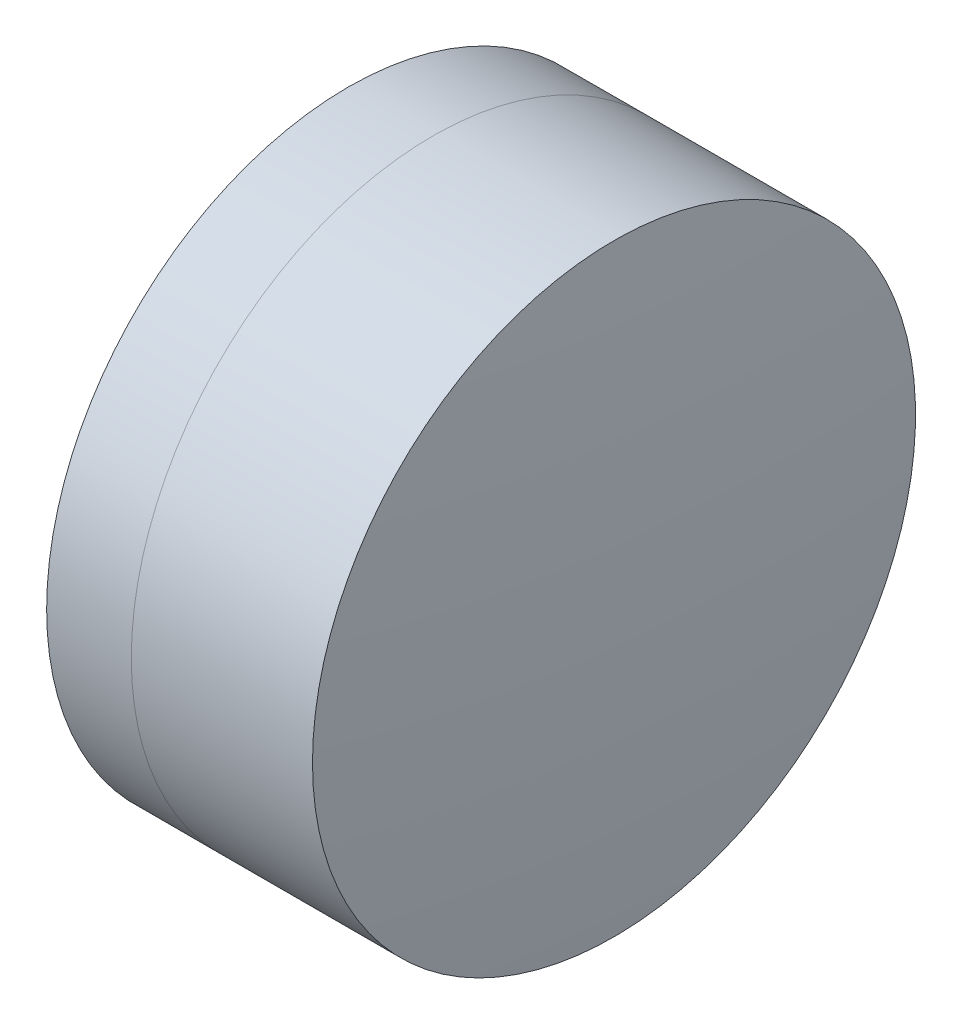
ISO-10303-21;
HEADER;
FILE_DESCRIPTION(('STEP AP214'),'2;1');
FILE_NAME('part.step','',(''),(''),'','','');
FILE_SCHEMA(('AUTOMOTIVE_DESIGN { 1 0 10303 214 1 1 1 1 }'));
ENDSEC;
DATA;
#1=APPLICATION_CONTEXT('core data for automotive mechanical design processes');
#2=APPLICATION_PROTOCOL_DEFINITION('international standard','automotive_design',2000,#1);
#3=PRODUCT_CONTEXT('',#1,'mechanical');
#4=PRODUCT('Part','Part','',(#3));
#5=PRODUCT_RELATED_PRODUCT_CATEGORY('part','',(#4));
#6=PRODUCT_DEFINITION_FORMATION('','',#4);
#7=PRODUCT_DEFINITION_CONTEXT('part definition',#1,'design');
#8=PRODUCT_DEFINITION('design','',#6,#7);
#9=PRODUCT_DEFINITION_SHAPE('','',#8);
#10=(LENGTH_UNIT() NAMED_UNIT(*) SI_UNIT(.MILLI.,.METRE.));
#11=(NAMED_UNIT(*) PLANE_ANGLE_UNIT() SI_UNIT($,.RADIAN.));
#12=(NAMED_UNIT(*) SI_UNIT($,.STERADIAN.) SOLID_ANGLE_UNIT());
#13=UNCERTAINTY_MEASURE_WITH_UNIT(LENGTH_MEASURE(1.E-05),#10,'distance_accuracy_value','');
#14=(GEOMETRIC_REPRESENTATION_CONTEXT(3) GLOBAL_UNCERTAINTY_ASSIGNED_CONTEXT((#13)) GLOBAL_UNIT_ASSIGNED_CONTEXT((#10,
#11,#12)) REPRESENTATION_CONTEXT('',''));
#15=CARTESIAN_POINT('',(0.,0.,0.));
#16=DIRECTION('',(0.,0.,1.));
#17=DIRECTION('',(1.,0.,0.));
#18=AXIS2_PLACEMENT_3D('',#15,#16,#17);
#19=CARTESIAN_POINT('',(-9.12217084702924,0.,0.));
#20=DIRECTION('',(-1.,0.,0.));
#21=DIRECTION('',(0.,0.,1.));
#22=AXIS2_PLACEMENT_3D('',#19,#20,#21);
#23=SPHERICAL_SURFACE('',#22,10.6);
#24=CARTESIAN_POINT('',(-0.634680051747038,0.,0.));
#25=DIRECTION('',(-1.,0.,0.));
#26=DIRECTION('',(0.,0.,1.));
#27=AXIS2_PLACEMENT_3D('',#24,#25,#26);
#28=CIRCLE('',#27,6.35);
#29=CARTESIAN_POINT('',(-0.634680051747038,0.,6.35));
#30=VERTEX_POINT('',#29);
#31=EDGE_CURVE('E11',#30,#30,#28,.T.);
#32=ORIENTED_EDGE('',*,*,#31,.T.);
#33=EDGE_LOOP('',(#32));
#34=FACE_BOUND('',#33,.T.);
#35=ADVANCED_FACE('F53',(#34),#23,.F.);
#36=CARTESIAN_POINT('',(-0.551919992657797,0.,0.));
#37=DIRECTION('',(-1.,0.,0.));
#38=DIRECTION('',(0.,0.,1.));
#39=AXIS2_PLACEMENT_3D('',#36,#37,#38);
#40=CYLINDRICAL_SURFACE('',#39,6.35);
#41=CARTESIAN_POINT('',(3.18112922015039,0.,0.));
#42=DIRECTION('',(-1.,0.,0.));
#43=DIRECTION('',(0.,0.,1.));
#44=AXIS2_PLACEMENT_3D('',#41,#42,#43);
#45=CIRCLE('',#44,6.35);
#46=CARTESIAN_POINT('',(3.18112922015039,0.,6.35));
#47=VERTEX_POINT('',#46);
#48=EDGE_CURVE('E60',#47,#47,#45,.T.);
#49=ORIENTED_EDGE('',*,*,#48,.T.);
#50=EDGE_LOOP('',(#49));
#51=FACE_BOUND('',#50,.T.);
#52=ORIENTED_EDGE('',*,*,#31,.F.);
#53=EDGE_LOOP('',(#52));
#54=FACE_BOUND('',#53,.T.);
#55=ADVANCED_FACE('F67',(#51,#54),#40,.T.);
#56=CARTESIAN_POINT('',(-64.6221708470292,0.,0.));
#57=DIRECTION('',(-1.,0.,0.));
#58=DIRECTION('',(0.,0.,1.));
#59=AXIS2_PLACEMENT_3D('',#56,#57,#58);
#60=SPHERICAL_SURFACE('',#59,68.1);
#61=ORIENTED_EDGE('',*,*,#48,.F.);
#62=EDGE_LOOP('',(#61));
#63=FACE_BOUND('',#62,.T.);
#64=ADVANCED_FACE('F70',(#63),#60,.T.);
#65=CLOSED_SHELL('',(#35,#55,#64));
#66=MANIFOLD_SOLID_BREP('B2',#65);
#67=CARTESIAN_POINT('',(15.2778291529708,0.,0.));
#68=DIRECTION('',(-1.,0.,0.));
#69=DIRECTION('',(0.,0.,-1.));
#70=AXIS2_PLACEMENT_3D('',#67,#68,#69);
#71=SPHERICAL_SURFACE('',#70,18.8);
#72=CARTESIAN_POINT('',(-2.41729729472664,0.,0.));
#73=DIRECTION('',(-1.,0.,0.));
#74=DIRECTION('',(0.,0.,1.));
#75=AXIS2_PLACEMENT_3D('',#72,#73,#74);
#76=CIRCLE('',#75,6.35);
#77=CARTESIAN_POINT('',(-2.41729729472664,0.,6.35));
#78=VERTEX_POINT('',#77);
#79=EDGE_CURVE('E52',#78,#78,#76,.T.);
#80=ORIENTED_EDGE('',*,*,#79,.T.);
#81=EDGE_LOOP('',(#80));
#82=FACE_BOUND('',#81,.T.);
#83=ADVANCED_FACE('F101',(#82),#71,.T.);
#84=CARTESIAN_POINT('',(-9.70261217833668,0.,0.));
#85=DIRECTION('',(-1.,0.,0.));
#86=DIRECTION('',(0.,0.,1.));
#87=AXIS2_PLACEMENT_3D('',#84,#85,#86);
#88=CYLINDRICAL_SURFACE('',#87,6.35);
#89=CARTESIAN_POINT('',(-0.634680051747036,0.,0.));
#90=DIRECTION('',(-1.,0.,0.));
#91=DIRECTION('',(0.,0.,1.));
#92=AXIS2_PLACEMENT_3D('',#89,#90,#91);
#93=CIRCLE('',#92,6.35);
#94=CARTESIAN_POINT('',(-0.634680051747036,0.,6.35));
#95=VERTEX_POINT('',#94);
#96=EDGE_CURVE('E108',#95,#95,#93,.T.);
#97=ORIENTED_EDGE('',*,*,#96,.T.);
#98=EDGE_LOOP('',(#97));
#99=FACE_BOUND('',#98,.T.);
#100=ORIENTED_EDGE('',*,*,#79,.F.);
#101=EDGE_LOOP('',(#100));
#102=FACE_BOUND('',#101,.T.);
#103=ADVANCED_FACE('F115',(#99,#102),#88,.T.);
#104=CARTESIAN_POINT('',(-9.12217084702924,0.,0.));
#105=DIRECTION('',(-1.,0.,0.));
#106=DIRECTION('',(0.,0.,1.));
#107=AXIS2_PLACEMENT_3D('',#104,#105,#106);
#108=SPHERICAL_SURFACE('',#107,10.6);
#109=ORIENTED_EDGE('',*,*,#96,.F.);
#110=EDGE_LOOP('',(#109));
#111=FACE_BOUND('',#110,.T.);
#112=ADVANCED_FACE('F118',(#111),#108,.T.);
#113=CLOSED_SHELL('',(#83,#103,#112));
#114=MANIFOLD_SOLID_BREP('B6',#113);
#115=ADVANCED_BREP_SHAPE_REPRESENTATION('',(#18,#66,#114),#14);
#116=SHAPE_DEFINITION_REPRESENTATION(#9,#115);
ENDSEC;
END-ISO-10303-21;
